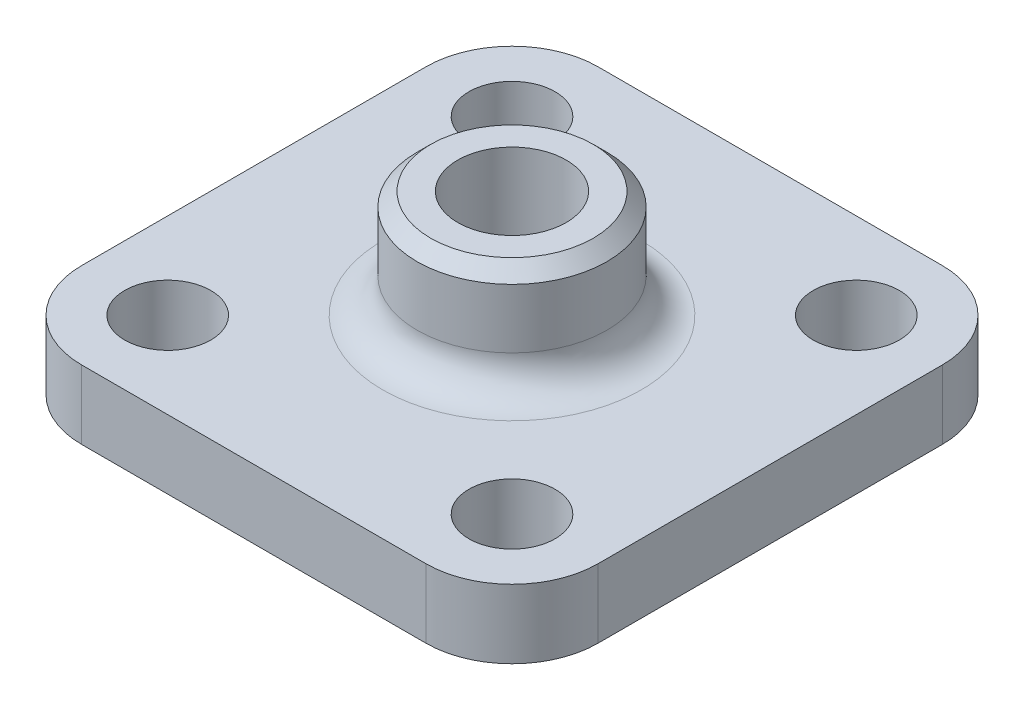
ISO-10303-21;
HEADER;
FILE_DESCRIPTION(('STEP AP214'),'2;1');
FILE_NAME('part.step','',(''),(''),'','','');
FILE_SCHEMA(('AUTOMOTIVE_DESIGN { 1 0 10303 214 1 1 1 1 }'));
ENDSEC;
DATA;
#1=APPLICATION_CONTEXT('core data for automotive mechanical design processes');
#2=APPLICATION_PROTOCOL_DEFINITION('international standard','automotive_design',2000,#1);
#3=PRODUCT_CONTEXT('',#1,'mechanical');
#4=PRODUCT('Part','Part','',(#3));
#5=PRODUCT_RELATED_PRODUCT_CATEGORY('part','',(#4));
#6=PRODUCT_DEFINITION_FORMATION('','',#4);
#7=PRODUCT_DEFINITION_CONTEXT('part definition',#1,'design');
#8=PRODUCT_DEFINITION('design','',#6,#7);
#9=PRODUCT_DEFINITION_SHAPE('','',#8);
#10=(LENGTH_UNIT() NAMED_UNIT(*) SI_UNIT(.MILLI.,.METRE.));
#11=(NAMED_UNIT(*) PLANE_ANGLE_UNIT() SI_UNIT($,.RADIAN.));
#12=(NAMED_UNIT(*) SI_UNIT($,.STERADIAN.) SOLID_ANGLE_UNIT());
#13=UNCERTAINTY_MEASURE_WITH_UNIT(LENGTH_MEASURE(1.E-05),#10,'distance_accuracy_value','');
#14=(GEOMETRIC_REPRESENTATION_CONTEXT(3) GLOBAL_UNCERTAINTY_ASSIGNED_CONTEXT((#13)) GLOBAL_UNIT_ASSIGNED_CONTEXT((#10,
#11,#12)) REPRESENTATION_CONTEXT('',''));
#15=CARTESIAN_POINT('',(0.,0.,0.));
#16=DIRECTION('',(0.,0.,1.));
#17=DIRECTION('',(1.,0.,0.));
#18=AXIS2_PLACEMENT_3D('',#15,#16,#17);
#19=CARTESIAN_POINT('',(0.,5.08,0.));
#20=DIRECTION('',(0.,-1.,0.));
#21=DIRECTION('',(0.,0.,-1.));
#22=AXIS2_PLACEMENT_3D('',#19,#20,#21);
#23=PLANE('',#22);
#24=CARTESIAN_POINT('',(0.,5.08,0.));
#25=DIRECTION('',(0.,-1.,0.));
#26=DIRECTION('',(0.,0.,-1.));
#27=AXIS2_PLACEMENT_3D('',#24,#25,#26);
#28=CIRCLE('',#27,9.54);
#29=CARTESIAN_POINT('',(0.,5.08,-9.54));
#30=VERTEX_POINT('',#29);
#31=EDGE_CURVE('E142',#30,#30,#28,.T.);
#32=ORIENTED_EDGE('',*,*,#31,.T.);
#33=EDGE_LOOP('',(#32));
#34=FACE_BOUND('',#33,.T.);
#35=DIRECTION('',(0.,0.,1.));
#36=VECTOR('',#35,1.);
#37=CARTESIAN_POINT('',(-19.05,5.08,19.05));
#38=LINE('',#37,#36);
#39=CARTESIAN_POINT('',(-19.05,5.08,-12.7));
#40=VERTEX_POINT('',#39);
#41=CARTESIAN_POINT('',(-19.05,5.08,12.7));
#42=VERTEX_POINT('',#41);
#43=EDGE_CURVE('E192',#40,#42,#38,.T.);
#44=ORIENTED_EDGE('',*,*,#43,.T.);
#45=CARTESIAN_POINT('',(-12.7,5.08,12.7));
#46=DIRECTION('',(0.,-1.,0.));
#47=DIRECTION('',(0.,0.,-1.));
#48=AXIS2_PLACEMENT_3D('',#45,#46,#47);
#49=CIRCLE('',#48,6.35);
#50=CARTESIAN_POINT('',(-12.7,5.08,19.05));
#51=VERTEX_POINT('',#50);
#52=EDGE_CURVE('E168',#42,#51,#49,.F.);
#53=ORIENTED_EDGE('',*,*,#52,.T.);
#54=DIRECTION('',(1.,0.,0.));
#55=VECTOR('',#54,1.);
#56=CARTESIAN_POINT('',(-19.05,5.08,19.05));
#57=LINE('',#56,#55);
#58=CARTESIAN_POINT('',(12.7,5.08,19.05));
#59=VERTEX_POINT('',#58);
#60=EDGE_CURVE('E123',#51,#59,#57,.T.);
#61=ORIENTED_EDGE('',*,*,#60,.T.);
#62=CARTESIAN_POINT('',(12.7,5.08,12.7));
#63=DIRECTION('',(0.,-1.,0.));
#64=DIRECTION('',(0.,0.,-1.));
#65=AXIS2_PLACEMENT_3D('',#62,#63,#64);
#66=CIRCLE('',#65,6.35);
#67=CARTESIAN_POINT('',(19.05,5.08,12.7));
#68=VERTEX_POINT('',#67);
#69=EDGE_CURVE('E165',#59,#68,#66,.F.);
#70=ORIENTED_EDGE('',*,*,#69,.T.);
#71=DIRECTION('',(0.,0.,-1.));
#72=VECTOR('',#71,1.);
#73=CARTESIAN_POINT('',(19.05,5.08,19.05));
#74=LINE('',#73,#72);
#75=CARTESIAN_POINT('',(19.05,5.08,-12.7));
#76=VERTEX_POINT('',#75);
#77=EDGE_CURVE('E130',#68,#76,#74,.T.);
#78=ORIENTED_EDGE('',*,*,#77,.T.);
#79=CARTESIAN_POINT('',(12.7,5.08,-12.7));
#80=DIRECTION('',(0.,-1.,0.));
#81=DIRECTION('',(0.,0.,-1.));
#82=AXIS2_PLACEMENT_3D('',#79,#80,#81);
#83=CIRCLE('',#82,6.35);
#84=CARTESIAN_POINT('',(12.7,5.08,-19.05));
#85=VERTEX_POINT('',#84);
#86=EDGE_CURVE('E57',#76,#85,#83,.F.);
#87=ORIENTED_EDGE('',*,*,#86,.T.);
#88=DIRECTION('',(-1.,0.,0.));
#89=VECTOR('',#88,1.);
#90=CARTESIAN_POINT('',(-19.05,5.08,-19.05));
#91=LINE('',#90,#89);
#92=CARTESIAN_POINT('',(-12.7,5.08,-19.05));
#93=VERTEX_POINT('',#92);
#94=EDGE_CURVE('E133',#85,#93,#91,.T.);
#95=ORIENTED_EDGE('',*,*,#94,.T.);
#96=CARTESIAN_POINT('',(-12.7,5.08,-12.7));
#97=DIRECTION('',(0.,-1.,0.));
#98=DIRECTION('',(0.,0.,-1.));
#99=AXIS2_PLACEMENT_3D('',#96,#97,#98);
#100=CIRCLE('',#99,6.35);
#101=EDGE_CURVE('E162',#93,#40,#100,.F.);
#102=ORIENTED_EDGE('',*,*,#101,.T.);
#103=EDGE_LOOP('',(#44,#53,#61,#70,#78,#87,#95,#102));
#104=FACE_BOUND('',#103,.T.);
#105=CARTESIAN_POINT('',(-12.7,5.08,12.7));
#106=DIRECTION('',(0.,1.,0.));
#107=DIRECTION('',(0.,0.,1.));
#108=AXIS2_PLACEMENT_3D('',#105,#106,#107);
#109=CIRCLE('',#108,3.175);
#110=CARTESIAN_POINT('',(-12.7,5.08,15.875));
#111=VERTEX_POINT('',#110);
#112=EDGE_CURVE('E198',#111,#111,#109,.T.);
#113=ORIENTED_EDGE('',*,*,#112,.F.);
#114=EDGE_LOOP('',(#113));
#115=FACE_BOUND('',#114,.T.);
#116=CARTESIAN_POINT('',(12.7,5.08,12.7));
#117=DIRECTION('',(0.,1.,0.));
#118=DIRECTION('',(0.,0.,1.));
#119=AXIS2_PLACEMENT_3D('',#116,#117,#118);
#120=CIRCLE('',#119,3.175);
#121=CARTESIAN_POINT('',(12.7,5.08,15.875));
#122=VERTEX_POINT('',#121);
#123=EDGE_CURVE('E204',#122,#122,#120,.T.);
#124=ORIENTED_EDGE('',*,*,#123,.F.);
#125=EDGE_LOOP('',(#124));
#126=FACE_BOUND('',#125,.T.);
#127=CARTESIAN_POINT('',(12.7,5.08,-12.7));
#128=DIRECTION('',(0.,1.,0.));
#129=DIRECTION('',(0.,0.,1.));
#130=AXIS2_PLACEMENT_3D('',#127,#128,#129);
#131=CIRCLE('',#130,3.175);
#132=CARTESIAN_POINT('',(12.7,5.08,-9.52500000000001));
#133=VERTEX_POINT('',#132);
#134=EDGE_CURVE('E211',#133,#133,#131,.T.);
#135=ORIENTED_EDGE('',*,*,#134,.F.);
#136=EDGE_LOOP('',(#135));
#137=FACE_BOUND('',#136,.T.);
#138=CARTESIAN_POINT('',(-12.7,5.08,-12.7));
#139=DIRECTION('',(0.,1.,0.));
#140=DIRECTION('',(0.,0.,1.));
#141=AXIS2_PLACEMENT_3D('',#138,#139,#140);
#142=CIRCLE('',#141,3.175);
#143=CARTESIAN_POINT('',(-12.7,5.08,-9.52500000000001));
#144=VERTEX_POINT('',#143);
#145=EDGE_CURVE('E217',#144,#144,#142,.T.);
#146=ORIENTED_EDGE('',*,*,#145,.F.);
#147=EDGE_LOOP('',(#146));
#148=FACE_BOUND('',#147,.T.);
#149=ADVANCED_FACE('F36',(#34,#104,#115,#126,#137,#148),#23,.F.);
#150=CARTESIAN_POINT('',(0.,0.,0.));
#151=DIRECTION('',(0.,-1.,0.));
#152=DIRECTION('',(0.,0.,-1.));
#153=AXIS2_PLACEMENT_3D('',#150,#151,#152);
#154=PLANE('',#153);
#155=CARTESIAN_POINT('',(-12.7,0.,-12.7));
#156=DIRECTION('',(0.,1.,0.));
#157=DIRECTION('',(0.,0.,1.));
#158=AXIS2_PLACEMENT_3D('',#155,#156,#157);
#159=CIRCLE('',#158,3.175);
#160=CARTESIAN_POINT('',(-12.7,0.,-9.52500000000001));
#161=VERTEX_POINT('',#160);
#162=EDGE_CURVE('E214',#161,#161,#159,.T.);
#163=ORIENTED_EDGE('',*,*,#162,.T.);
#164=EDGE_LOOP('',(#163));
#165=FACE_BOUND('',#164,.T.);
#166=CARTESIAN_POINT('',(12.7,0.,-12.7));
#167=DIRECTION('',(0.,1.,0.));
#168=DIRECTION('',(0.,0.,1.));
#169=AXIS2_PLACEMENT_3D('',#166,#167,#168);
#170=CIRCLE('',#169,3.175);
#171=CARTESIAN_POINT('',(12.7,0.,-9.52500000000001));
#172=VERTEX_POINT('',#171);
#173=EDGE_CURVE('E208',#172,#172,#170,.T.);
#174=ORIENTED_EDGE('',*,*,#173,.T.);
#175=EDGE_LOOP('',(#174));
#176=FACE_BOUND('',#175,.T.);
#177=CARTESIAN_POINT('',(12.7,0.,12.7));
#178=DIRECTION('',(0.,1.,0.));
#179=DIRECTION('',(0.,0.,1.));
#180=AXIS2_PLACEMENT_3D('',#177,#178,#179);
#181=CIRCLE('',#180,3.175);
#182=CARTESIAN_POINT('',(12.7,0.,15.875));
#183=VERTEX_POINT('',#182);
#184=EDGE_CURVE('E201',#183,#183,#181,.T.);
#185=ORIENTED_EDGE('',*,*,#184,.T.);
#186=EDGE_LOOP('',(#185));
#187=FACE_BOUND('',#186,.T.);
#188=CARTESIAN_POINT('',(-12.7,0.,12.7));
#189=DIRECTION('',(0.,1.,0.));
#190=DIRECTION('',(0.,0.,1.));
#191=AXIS2_PLACEMENT_3D('',#188,#189,#190);
#192=CIRCLE('',#191,3.175);
#193=CARTESIAN_POINT('',(-12.7,0.,15.875));
#194=VERTEX_POINT('',#193);
#195=EDGE_CURVE('E187',#194,#194,#192,.T.);
#196=ORIENTED_EDGE('',*,*,#195,.T.);
#197=EDGE_LOOP('',(#196));
#198=FACE_BOUND('',#197,.T.);
#199=DIRECTION('',(1.,0.,0.));
#200=VECTOR('',#199,1.);
#201=CARTESIAN_POINT('',(-19.05,0.,19.05));
#202=LINE('',#201,#200);
#203=CARTESIAN_POINT('',(-12.7,0.,19.05));
#204=VERTEX_POINT('',#203);
#205=CARTESIAN_POINT('',(12.7,0.,19.05));
#206=VERTEX_POINT('',#205);
#207=EDGE_CURVE('E120',#204,#206,#202,.T.);
#208=ORIENTED_EDGE('',*,*,#207,.F.);
#209=CARTESIAN_POINT('',(-12.7,0.,12.7));
#210=DIRECTION('',(0.,-1.,0.));
#211=DIRECTION('',(0.,0.,-1.));
#212=AXIS2_PLACEMENT_3D('',#209,#210,#211);
#213=CIRCLE('',#212,6.35);
#214=CARTESIAN_POINT('',(-19.05,0.,12.7));
#215=VERTEX_POINT('',#214);
#216=EDGE_CURVE('E103',#204,#215,#213,.T.);
#217=ORIENTED_EDGE('',*,*,#216,.T.);
#218=DIRECTION('',(0.,0.,1.));
#219=VECTOR('',#218,1.);
#220=CARTESIAN_POINT('',(-19.05,0.,19.05));
#221=LINE('',#220,#219);
#222=CARTESIAN_POINT('',(-19.05,0.,-12.7));
#223=VERTEX_POINT('',#222);
#224=EDGE_CURVE('E131',#223,#215,#221,.T.);
#225=ORIENTED_EDGE('',*,*,#224,.F.);
#226=CARTESIAN_POINT('',(-12.7,0.,-12.7));
#227=DIRECTION('',(0.,-1.,0.));
#228=DIRECTION('',(0.,0.,-1.));
#229=AXIS2_PLACEMENT_3D('',#226,#227,#228);
#230=CIRCLE('',#229,6.35);
#231=CARTESIAN_POINT('',(-12.7,0.,-19.05));
#232=VERTEX_POINT('',#231);
#233=EDGE_CURVE('E124',#223,#232,#230,.T.);
#234=ORIENTED_EDGE('',*,*,#233,.T.);
#235=DIRECTION('',(-1.,0.,0.));
#236=VECTOR('',#235,1.);
#237=CARTESIAN_POINT('',(-19.05,0.,-19.05));
#238=LINE('',#237,#236);
#239=CARTESIAN_POINT('',(12.7,0.,-19.05));
#240=VERTEX_POINT('',#239);
#241=EDGE_CURVE('E135',#240,#232,#238,.T.);
#242=ORIENTED_EDGE('',*,*,#241,.F.);
#243=CARTESIAN_POINT('',(12.7,0.,-12.7));
#244=DIRECTION('',(0.,-1.,0.));
#245=DIRECTION('',(0.,0.,-1.));
#246=AXIS2_PLACEMENT_3D('',#243,#244,#245);
#247=CIRCLE('',#246,6.35);
#248=CARTESIAN_POINT('',(19.05,0.,-12.7));
#249=VERTEX_POINT('',#248);
#250=EDGE_CURVE('E156',#240,#249,#247,.T.);
#251=ORIENTED_EDGE('',*,*,#250,.T.);
#252=DIRECTION('',(0.,0.,-1.));
#253=VECTOR('',#252,1.);
#254=CARTESIAN_POINT('',(19.05,0.,19.05));
#255=LINE('',#254,#253);
#256=CARTESIAN_POINT('',(19.05,0.,12.7));
#257=VERTEX_POINT('',#256);
#258=EDGE_CURVE('E179',#257,#249,#255,.T.);
#259=ORIENTED_EDGE('',*,*,#258,.F.);
#260=CARTESIAN_POINT('',(12.7,0.,12.7));
#261=DIRECTION('',(0.,-1.,0.));
#262=DIRECTION('',(0.,0.,-1.));
#263=AXIS2_PLACEMENT_3D('',#260,#261,#262);
#264=CIRCLE('',#263,6.35);
#265=EDGE_CURVE('E114',#257,#206,#264,.T.);
#266=ORIENTED_EDGE('',*,*,#265,.T.);
#267=EDGE_LOOP('',(#208,#217,#225,#234,#242,#251,#259,#266));
#268=FACE_BOUND('',#267,.T.);
#269=CARTESIAN_POINT('',(0.,0.,0.));
#270=DIRECTION('',(0.,1.,0.));
#271=DIRECTION('',(0.,0.,1.));
#272=AXIS2_PLACEMENT_3D('',#269,#270,#271);
#273=CIRCLE('',#272,4.);
#274=CARTESIAN_POINT('',(0.,0.,4.));
#275=VERTEX_POINT('',#274);
#276=EDGE_CURVE('E184',#275,#275,#273,.T.);
#277=ORIENTED_EDGE('',*,*,#276,.T.);
#278=EDGE_LOOP('',(#277));
#279=FACE_BOUND('',#278,.T.);
#280=ADVANCED_FACE('F127',(#165,#176,#187,#198,#268,#279),#154,.T.);
#281=CARTESIAN_POINT('',(19.05,5.08,19.05));
#282=DIRECTION('',(-1.,0.,0.));
#283=DIRECTION('',(0.,0.,1.));
#284=AXIS2_PLACEMENT_3D('',#281,#282,#283);
#285=PLANE('',#284);
#286=ORIENTED_EDGE('',*,*,#77,.F.);
#287=DIRECTION('',(0.,-1.,0.));
#288=VECTOR('',#287,1.);
#289=CARTESIAN_POINT('',(19.05,5.08,12.7));
#290=LINE('',#289,#288);
#291=EDGE_CURVE('E172',#68,#257,#290,.T.);
#292=ORIENTED_EDGE('',*,*,#291,.T.);
#293=ORIENTED_EDGE('',*,*,#258,.T.);
#294=DIRECTION('',(0.,-1.,0.));
#295=VECTOR('',#294,1.);
#296=CARTESIAN_POINT('',(19.05,5.08,-12.7));
#297=LINE('',#296,#295);
#298=EDGE_CURVE('E170',#249,#76,#297,.F.);
#299=ORIENTED_EDGE('',*,*,#298,.T.);
#300=EDGE_LOOP('',(#286,#292,#293,#299));
#301=FACE_BOUND('',#300,.T.);
#302=ADVANCED_FACE('F178',(#301),#285,.F.);
#303=CARTESIAN_POINT('',(-19.05,5.08,-19.05));
#304=DIRECTION('',(0.,0.,1.));
#305=DIRECTION('',(1.,0.,0.));
#306=AXIS2_PLACEMENT_3D('',#303,#304,#305);
#307=PLANE('',#306);
#308=ORIENTED_EDGE('',*,*,#94,.F.);
#309=DIRECTION('',(0.,-1.,0.));
#310=VECTOR('',#309,1.);
#311=CARTESIAN_POINT('',(12.7,5.08,-19.05));
#312=LINE('',#311,#310);
#313=EDGE_CURVE('E11',#85,#240,#312,.T.);
#314=ORIENTED_EDGE('',*,*,#313,.T.);
#315=ORIENTED_EDGE('',*,*,#241,.T.);
#316=DIRECTION('',(0.,-1.,0.));
#317=VECTOR('',#316,1.);
#318=CARTESIAN_POINT('',(-12.7,5.08,-19.05));
#319=LINE('',#318,#317);
#320=EDGE_CURVE('E44',#232,#93,#319,.F.);
#321=ORIENTED_EDGE('',*,*,#320,.T.);
#322=EDGE_LOOP('',(#308,#314,#315,#321));
#323=FACE_BOUND('',#322,.T.);
#324=ADVANCED_FACE('F259',(#323),#307,.F.);
#325=CARTESIAN_POINT('',(-19.05,5.08,19.05));
#326=DIRECTION('',(1.,0.,0.));
#327=DIRECTION('',(0.,0.,-1.));
#328=AXIS2_PLACEMENT_3D('',#325,#326,#327);
#329=PLANE('',#328);
#330=ORIENTED_EDGE('',*,*,#224,.T.);
#331=DIRECTION('',(0.,-1.,0.));
#332=VECTOR('',#331,1.);
#333=CARTESIAN_POINT('',(-19.05,5.08,12.7));
#334=LINE('',#333,#332);
#335=EDGE_CURVE('E108',#215,#42,#334,.F.);
#336=ORIENTED_EDGE('',*,*,#335,.T.);
#337=ORIENTED_EDGE('',*,*,#43,.F.);
#338=DIRECTION('',(0.,-1.,0.));
#339=VECTOR('',#338,1.);
#340=CARTESIAN_POINT('',(-19.05,5.08,-12.7));
#341=LINE('',#340,#339);
#342=EDGE_CURVE('E113',#40,#223,#341,.T.);
#343=ORIENTED_EDGE('',*,*,#342,.T.);
#344=EDGE_LOOP('',(#330,#336,#337,#343));
#345=FACE_BOUND('',#344,.T.);
#346=ADVANCED_FACE('F256',(#345),#329,.F.);
#347=CARTESIAN_POINT('',(-19.05,5.08,19.05));
#348=DIRECTION('',(0.,0.,-1.));
#349=DIRECTION('',(-1.,0.,0.));
#350=AXIS2_PLACEMENT_3D('',#347,#348,#349);
#351=PLANE('',#350);
#352=ORIENTED_EDGE('',*,*,#60,.F.);
#353=DIRECTION('',(0.,-1.,0.));
#354=VECTOR('',#353,1.);
#355=CARTESIAN_POINT('',(-12.7,5.08,19.05));
#356=LINE('',#355,#354);
#357=EDGE_CURVE('E107',#51,#204,#356,.T.);
#358=ORIENTED_EDGE('',*,*,#357,.T.);
#359=ORIENTED_EDGE('',*,*,#207,.T.);
#360=DIRECTION('',(0.,-1.,0.));
#361=VECTOR('',#360,1.);
#362=CARTESIAN_POINT('',(12.7,5.08,19.05));
#363=LINE('',#362,#361);
#364=EDGE_CURVE('E125',#206,#59,#363,.F.);
#365=ORIENTED_EDGE('',*,*,#364,.T.);
#366=EDGE_LOOP('',(#352,#358,#359,#365));
#367=FACE_BOUND('',#366,.T.);
#368=ADVANCED_FACE('F119',(#367),#351,.F.);
#369=CARTESIAN_POINT('',(0.,5.08,0.));
#370=DIRECTION('',(0.,-1.,0.));
#371=DIRECTION('',(0.,0.,-1.));
#372=AXIS2_PLACEMENT_3D('',#369,#370,#371);
#373=CYLINDRICAL_SURFACE('',#372,4.);
#374=ORIENTED_EDGE('',*,*,#276,.F.);
#375=EDGE_LOOP('',(#374));
#376=FACE_BOUND('',#375,.T.);
#377=CARTESIAN_POINT('',(0.,13.,0.));
#378=DIRECTION('',(0.,1.,0.));
#379=DIRECTION('',(0.,0.,1.));
#380=AXIS2_PLACEMENT_3D('',#377,#378,#379);
#381=CIRCLE('',#380,4.);
#382=CARTESIAN_POINT('',(0.,13.,4.));
#383=VERTEX_POINT('',#382);
#384=EDGE_CURVE('E220',#383,#383,#381,.T.);
#385=ORIENTED_EDGE('',*,*,#384,.T.);
#386=EDGE_LOOP('',(#385));
#387=FACE_BOUND('',#386,.T.);
#388=ADVANCED_FACE('F225',(#376,#387),#373,.F.);
#389=CARTESIAN_POINT('',(-12.7,5.08,12.7));
#390=DIRECTION('',(0.,1.,0.));
#391=DIRECTION('',(0.,0.,1.));
#392=AXIS2_PLACEMENT_3D('',#389,#390,#391);
#393=CYLINDRICAL_SURFACE('',#392,3.175);
#394=ORIENTED_EDGE('',*,*,#195,.F.);
#395=EDGE_LOOP('',(#394));
#396=FACE_BOUND('',#395,.T.);
#397=ORIENTED_EDGE('',*,*,#112,.T.);
#398=EDGE_LOOP('',(#397));
#399=FACE_BOUND('',#398,.T.);
#400=ADVANCED_FACE('F304',(#396,#399),#393,.F.);
#401=CARTESIAN_POINT('',(12.7,5.08,12.7));
#402=DIRECTION('',(0.,1.,0.));
#403=DIRECTION('',(0.,0.,1.));
#404=AXIS2_PLACEMENT_3D('',#401,#402,#403);
#405=CYLINDRICAL_SURFACE('',#404,3.175);
#406=ORIENTED_EDGE('',*,*,#184,.F.);
#407=EDGE_LOOP('',(#406));
#408=FACE_BOUND('',#407,.T.);
#409=ORIENTED_EDGE('',*,*,#123,.T.);
#410=EDGE_LOOP('',(#409));
#411=FACE_BOUND('',#410,.T.);
#412=ADVANCED_FACE('F298',(#408,#411),#405,.F.);
#413=CARTESIAN_POINT('',(12.7,5.08,-12.7));
#414=DIRECTION('',(0.,1.,0.));
#415=DIRECTION('',(0.,0.,1.));
#416=AXIS2_PLACEMENT_3D('',#413,#414,#415);
#417=CYLINDRICAL_SURFACE('',#416,3.175);
#418=ORIENTED_EDGE('',*,*,#173,.F.);
#419=EDGE_LOOP('',(#418));
#420=FACE_BOUND('',#419,.T.);
#421=ORIENTED_EDGE('',*,*,#134,.T.);
#422=EDGE_LOOP('',(#421));
#423=FACE_BOUND('',#422,.T.);
#424=ADVANCED_FACE('F240',(#420,#423),#417,.F.);
#425=CARTESIAN_POINT('',(-12.7,5.08,-12.7));
#426=DIRECTION('',(0.,1.,0.));
#427=DIRECTION('',(0.,0.,1.));
#428=AXIS2_PLACEMENT_3D('',#425,#426,#427);
#429=CYLINDRICAL_SURFACE('',#428,3.175);
#430=ORIENTED_EDGE('',*,*,#162,.F.);
#431=EDGE_LOOP('',(#430));
#432=FACE_BOUND('',#431,.T.);
#433=ORIENTED_EDGE('',*,*,#145,.T.);
#434=EDGE_LOOP('',(#433));
#435=FACE_BOUND('',#434,.T.);
#436=ADVANCED_FACE('F230',(#432,#435),#429,.F.);
#437=CARTESIAN_POINT('',(0.,13.,0.));
#438=DIRECTION('',(0.,1.,0.));
#439=DIRECTION('',(0.,0.,1.));
#440=AXIS2_PLACEMENT_3D('',#437,#438,#439);
#441=PLANE('',#440);
#442=CARTESIAN_POINT('',(0.,13.,0.));
#443=DIRECTION('',(0.,1.,0.));
#444=DIRECTION('',(0.,0.,1.));
#445=AXIS2_PLACEMENT_3D('',#442,#443,#444);
#446=CIRCLE('',#445,5.99999999999999);
#447=CARTESIAN_POINT('',(0.,13.,5.99999999999999));
#448=VERTEX_POINT('',#447);
#449=EDGE_CURVE('E145',#448,#448,#446,.T.);
#450=ORIENTED_EDGE('',*,*,#449,.T.);
#451=EDGE_LOOP('',(#450));
#452=FACE_BOUND('',#451,.T.);
#453=ORIENTED_EDGE('',*,*,#384,.F.);
#454=EDGE_LOOP('',(#453));
#455=FACE_BOUND('',#454,.T.);
#456=ADVANCED_FACE('F227',(#452,#455),#441,.T.);
#457=CARTESIAN_POINT('',(0.,13.,0.));
#458=DIRECTION('',(0.,-1.,0.));
#459=DIRECTION('',(0.,0.,-1.));
#460=AXIS2_PLACEMENT_3D('',#457,#458,#459);
#461=CYLINDRICAL_SURFACE('',#460,7.);
#462=CARTESIAN_POINT('',(0.,12.,0.));
#463=DIRECTION('',(0.,1.,0.));
#464=DIRECTION('',(0.,0.,1.));
#465=AXIS2_PLACEMENT_3D('',#462,#463,#464);
#466=CIRCLE('',#465,7.);
#467=CARTESIAN_POINT('',(0.,12.,7.));
#468=VERTEX_POINT('',#467);
#469=EDGE_CURVE('E149',#468,#468,#466,.F.);
#470=ORIENTED_EDGE('',*,*,#469,.T.);
#471=EDGE_LOOP('',(#470));
#472=FACE_BOUND('',#471,.T.);
#473=CARTESIAN_POINT('',(0.,7.62,0.));
#474=DIRECTION('',(0.,-1.,0.));
#475=DIRECTION('',(0.,0.,-1.));
#476=AXIS2_PLACEMENT_3D('',#473,#474,#475);
#477=CIRCLE('',#476,7.);
#478=CARTESIAN_POINT('',(0.,7.62,-7.));
#479=VERTEX_POINT('',#478);
#480=EDGE_CURVE('E139',#479,#479,#477,.F.);
#481=ORIENTED_EDGE('',*,*,#480,.T.);
#482=EDGE_LOOP('',(#481));
#483=FACE_BOUND('',#482,.T.);
#484=ADVANCED_FACE('F229',(#472,#483),#461,.T.);
#485=CARTESIAN_POINT('',(0.,7.62,0.));
#486=DIRECTION('',(0.,-1.,0.));
#487=DIRECTION('',(0.,0.,-1.));
#488=AXIS2_PLACEMENT_3D('',#485,#486,#487);
#489=TOROIDAL_SURFACE('',#488,9.54,2.54);
#490=ORIENTED_EDGE('',*,*,#31,.F.);
#491=EDGE_LOOP('',(#490));
#492=FACE_BOUND('',#491,.T.);
#493=ORIENTED_EDGE('',*,*,#480,.F.);
#494=EDGE_LOOP('',(#493));
#495=FACE_BOUND('',#494,.T.);
#496=ADVANCED_FACE('F237',(#492,#495),#489,.F.);
#497=CARTESIAN_POINT('',(0.,13.,0.));
#498=DIRECTION('',(0.,-1.,0.));
#499=DIRECTION('',(0.,0.,-1.));
#500=AXIS2_PLACEMENT_3D('',#497,#498,#499);
#501=CONICAL_SURFACE('',#500,5.99999999999999,0.785398163397447);
#502=ORIENTED_EDGE('',*,*,#469,.F.);
#503=EDGE_LOOP('',(#502));
#504=FACE_BOUND('',#503,.T.);
#505=ORIENTED_EDGE('',*,*,#449,.F.);
#506=EDGE_LOOP('',(#505));
#507=FACE_BOUND('',#506,.T.);
#508=ADVANCED_FACE('F267',(#504,#507),#501,.T.);
#509=CARTESIAN_POINT('',(-12.7,5.08,12.7));
#510=DIRECTION('',(0.,-1.,0.));
#511=DIRECTION('',(0.,0.,-1.));
#512=AXIS2_PLACEMENT_3D('',#509,#510,#511);
#513=CYLINDRICAL_SURFACE('',#512,6.35);
#514=ORIENTED_EDGE('',*,*,#52,.F.);
#515=ORIENTED_EDGE('',*,*,#335,.F.);
#516=ORIENTED_EDGE('',*,*,#216,.F.);
#517=ORIENTED_EDGE('',*,*,#357,.F.);
#518=EDGE_LOOP('',(#514,#515,#516,#517));
#519=FACE_BOUND('',#518,.T.);
#520=ADVANCED_FACE('F106',(#519),#513,.T.);
#521=CARTESIAN_POINT('',(12.7,5.08,12.7));
#522=DIRECTION('',(0.,-1.,0.));
#523=DIRECTION('',(0.,0.,-1.));
#524=AXIS2_PLACEMENT_3D('',#521,#522,#523);
#525=CYLINDRICAL_SURFACE('',#524,6.35);
#526=ORIENTED_EDGE('',*,*,#69,.F.);
#527=ORIENTED_EDGE('',*,*,#364,.F.);
#528=ORIENTED_EDGE('',*,*,#265,.F.);
#529=ORIENTED_EDGE('',*,*,#291,.F.);
#530=EDGE_LOOP('',(#526,#527,#528,#529));
#531=FACE_BOUND('',#530,.T.);
#532=ADVANCED_FACE('F274',(#531),#525,.T.);
#533=CARTESIAN_POINT('',(12.7,5.08,-12.7));
#534=DIRECTION('',(0.,-1.,0.));
#535=DIRECTION('',(0.,0.,-1.));
#536=AXIS2_PLACEMENT_3D('',#533,#534,#535);
#537=CYLINDRICAL_SURFACE('',#536,6.35);
#538=ORIENTED_EDGE('',*,*,#86,.F.);
#539=ORIENTED_EDGE('',*,*,#298,.F.);
#540=ORIENTED_EDGE('',*,*,#250,.F.);
#541=ORIENTED_EDGE('',*,*,#313,.F.);
#542=EDGE_LOOP('',(#538,#539,#540,#541));
#543=FACE_BOUND('',#542,.T.);
#544=ADVANCED_FACE('F276',(#543),#537,.T.);
#545=CARTESIAN_POINT('',(-12.7,5.08,-12.7));
#546=DIRECTION('',(0.,-1.,0.));
#547=DIRECTION('',(0.,0.,-1.));
#548=AXIS2_PLACEMENT_3D('',#545,#546,#547);
#549=CYLINDRICAL_SURFACE('',#548,6.35);
#550=ORIENTED_EDGE('',*,*,#101,.F.);
#551=ORIENTED_EDGE('',*,*,#320,.F.);
#552=ORIENTED_EDGE('',*,*,#233,.F.);
#553=ORIENTED_EDGE('',*,*,#342,.F.);
#554=EDGE_LOOP('',(#550,#551,#552,#553));
#555=FACE_BOUND('',#554,.T.);
#556=ADVANCED_FACE('F38',(#555),#549,.T.);
#557=CLOSED_SHELL('',(#149,#280,#302,#324,#346,#368,#388,#400,#412,#424,#436,#456,#484,#496,
#508,#520,#532,#544,#556));
#558=MANIFOLD_SOLID_BREP('B2',#557);
#559=ADVANCED_BREP_SHAPE_REPRESENTATION('',(#18,#558),#14);
#560=SHAPE_DEFINITION_REPRESENTATION(#9,#559);
ENDSEC;
END-ISO-10303-21;
